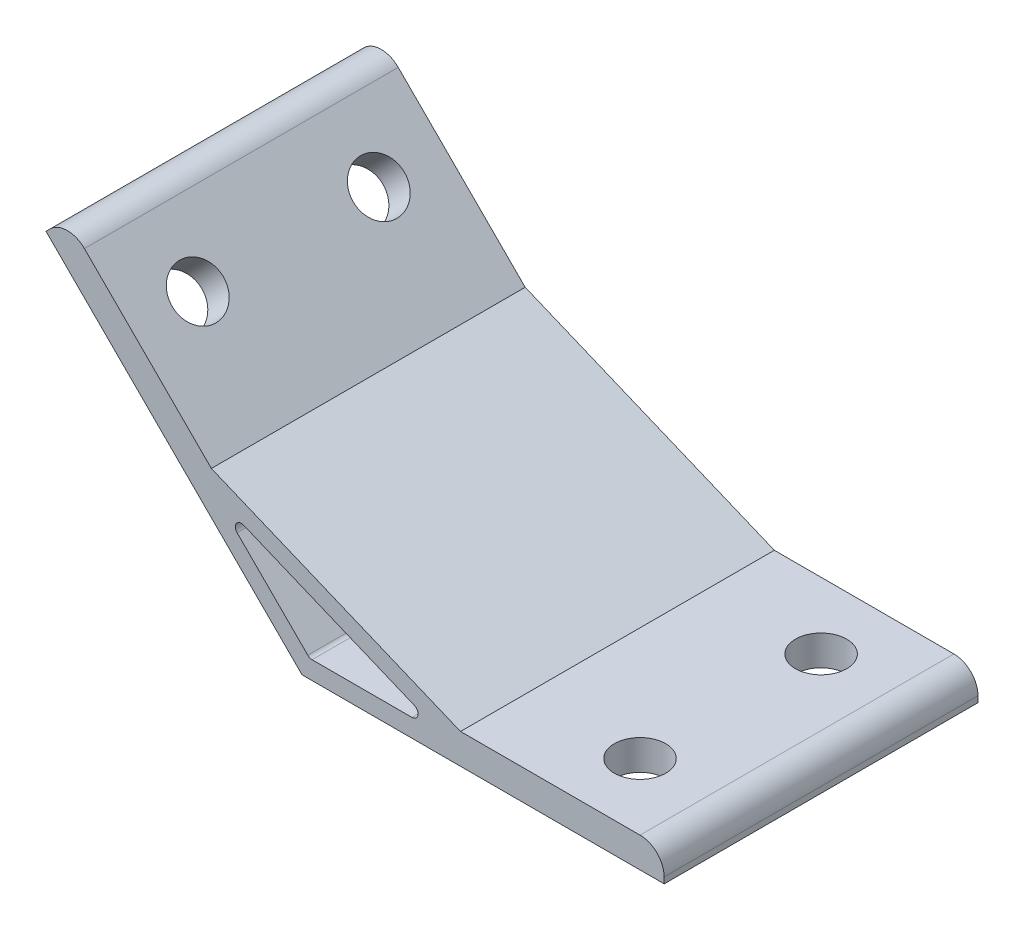
ISO-10303-21;
HEADER;
FILE_DESCRIPTION(('STEP AP214'),'2;1');
FILE_NAME('part.step','',(''),(''),'','','');
FILE_SCHEMA(('AUTOMOTIVE_DESIGN { 1 0 10303 214 1 1 1 1 }'));
ENDSEC;
DATA;
#1=APPLICATION_CONTEXT('core data for automotive mechanical design processes');
#2=APPLICATION_PROTOCOL_DEFINITION('international standard','automotive_design',2000,#1);
#3=PRODUCT_CONTEXT('',#1,'mechanical');
#4=PRODUCT('Part','Part','',(#3));
#5=PRODUCT_RELATED_PRODUCT_CATEGORY('part','',(#4));
#6=PRODUCT_DEFINITION_FORMATION('','',#4);
#7=PRODUCT_DEFINITION_CONTEXT('part definition',#1,'design');
#8=PRODUCT_DEFINITION('design','',#6,#7);
#9=PRODUCT_DEFINITION_SHAPE('','',#8);
#10=(LENGTH_UNIT() NAMED_UNIT(*) SI_UNIT(.MILLI.,.METRE.));
#11=(NAMED_UNIT(*) PLANE_ANGLE_UNIT() SI_UNIT($,.RADIAN.));
#12=(NAMED_UNIT(*) SI_UNIT($,.STERADIAN.) SOLID_ANGLE_UNIT());
#13=UNCERTAINTY_MEASURE_WITH_UNIT(LENGTH_MEASURE(1.E-05),#10,'distance_accuracy_value','');
#14=(GEOMETRIC_REPRESENTATION_CONTEXT(3) GLOBAL_UNCERTAINTY_ASSIGNED_CONTEXT((#13)) GLOBAL_UNIT_ASSIGNED_CONTEXT((#10,
#11,#12)) REPRESENTATION_CONTEXT('',''));
#15=CARTESIAN_POINT('',(0.,0.,0.));
#16=DIRECTION('',(0.,0.,1.));
#17=DIRECTION('',(1.,0.,0.));
#18=AXIS2_PLACEMENT_3D('',#15,#16,#17);
#19=CARTESIAN_POINT('',(0.,0.,26.));
#20=DIRECTION('',(0.,0.,1.));
#21=DIRECTION('',(1.,0.,0.));
#22=AXIS2_PLACEMENT_3D('',#19,#20,#21);
#23=PLANE('',#22);
#24=DIRECTION('',(0.,1.,0.));
#25=VECTOR('',#24,1.);
#26=CARTESIAN_POINT('',(60.,5.,26.));
#27=LINE('',#26,#25);
#28=CARTESIAN_POINT('',(60.,0.,26.));
#29=VERTEX_POINT('',#28);
#30=CARTESIAN_POINT('',(60.,1.,26.));
#31=VERTEX_POINT('',#30);
#32=EDGE_CURVE('E142',#29,#31,#27,.T.);
#33=ORIENTED_EDGE('',*,*,#32,.T.);
#34=CARTESIAN_POINT('',(56.,1.,26.));
#35=DIRECTION('',(0.,0.,1.));
#36=DIRECTION('',(1.,0.,0.));
#37=AXIS2_PLACEMENT_3D('',#34,#35,#36);
#38=CIRCLE('',#37,4.);
#39=CARTESIAN_POINT('',(56.,5.,26.));
#40=VERTEX_POINT('',#39);
#41=EDGE_CURVE('E184',#31,#40,#38,.T.);
#42=ORIENTED_EDGE('',*,*,#41,.T.);
#43=DIRECTION('',(-1.,0.,0.));
#44=VECTOR('',#43,1.);
#45=CARTESIAN_POINT('',(26.2535913516314,5.,26.));
#46=LINE('',#45,#44);
#47=CARTESIAN_POINT('',(26.2535913516314,5.,26.));
#48=VERTEX_POINT('',#47);
#49=EDGE_CURVE('E153',#40,#48,#46,.T.);
#50=ORIENTED_EDGE('',*,*,#49,.T.);
#51=DIRECTION('',(-0.923879532511286,0.382683432365091,0.));
#52=VECTOR('',#51,1.);
#53=CARTESIAN_POINT('',(-15.0285585693063,22.0996263811718,26.));
#54=LINE('',#53,#52);
#55=CARTESIAN_POINT('',(-15.0285585693063,22.0996263811718,26.));
#56=VERTEX_POINT('',#55);
#57=EDGE_CURVE('E244',#48,#56,#54,.T.);
#58=ORIENTED_EDGE('',*,*,#57,.T.);
#59=DIRECTION('',(-0.707106781186549,0.707106781186547,0.));
#60=VECTOR('',#59,1.);
#61=CARTESIAN_POINT('',(-38.8908729652601,45.9619407771256,26.));
#62=LINE('',#61,#60);
#63=CARTESIAN_POINT('',(-36.0624458405139,43.1335136523794,26.));
#64=VERTEX_POINT('',#63);
#65=EDGE_CURVE('E246',#56,#64,#62,.T.);
#66=ORIENTED_EDGE('',*,*,#65,.T.);
#67=CARTESIAN_POINT('',(-38.8908729652601,40.3050865276332,26.));
#68=DIRECTION('',(0.,0.,1.));
#69=DIRECTION('',(1.,0.,0.));
#70=AXIS2_PLACEMENT_3D('',#67,#68,#69);
#71=CIRCLE('',#70,4.);
#72=CARTESIAN_POINT('',(-41.7193000900063,43.1335136523794,26.));
#73=VERTEX_POINT('',#72);
#74=EDGE_CURVE('E182',#64,#73,#71,.T.);
#75=ORIENTED_EDGE('',*,*,#74,.T.);
#76=DIRECTION('',(-0.707106781186547,-0.707106781186548,0.));
#77=VECTOR('',#76,1.);
#78=CARTESIAN_POINT('',(-42.4264068711928,42.4264068711929,26.));
#79=LINE('',#78,#77);
#80=CARTESIAN_POINT('',(-42.4264068711928,42.4264068711929,26.));
#81=VERTEX_POINT('',#80);
#82=EDGE_CURVE('E249',#73,#81,#79,.T.);
#83=ORIENTED_EDGE('',*,*,#82,.T.);
#84=DIRECTION('',(0.707106781186546,-0.707106781186549,0.));
#85=VECTOR('',#84,1.);
#86=CARTESIAN_POINT('',(0.,0.,26.));
#87=LINE('',#86,#85);
#88=CARTESIAN_POINT('',(0.,0.,26.));
#89=VERTEX_POINT('',#88);
#90=EDGE_CURVE('E158',#81,#89,#87,.T.);
#91=ORIENTED_EDGE('',*,*,#90,.T.);
#92=DIRECTION('',(1.,0.,0.));
#93=VECTOR('',#92,1.);
#94=CARTESIAN_POINT('',(60.,0.,26.));
#95=LINE('',#94,#93);
#96=EDGE_CURVE('E154',#89,#29,#95,.T.);
#97=ORIENTED_EDGE('',*,*,#96,.T.);
#98=EDGE_LOOP('',(#33,#42,#50,#58,#66,#75,#83,#91,#97));
#99=FACE_BOUND('',#98,.T.);
#100=DIRECTION('',(1.,0.,0.));
#101=VECTOR('',#100,1.);
#102=CARTESIAN_POINT('',(23.2426406871193,3.,26.));
#103=LINE('',#102,#101);
#104=CARTESIAN_POINT('',(1.65685424949239,3.,26.));
#105=VERTEX_POINT('',#104);
#106=CARTESIAN_POINT('',(18.2153011949934,3.,26.));
#107=VERTEX_POINT('',#106);
#108=EDGE_CURVE('E229',#105,#107,#103,.T.);
#109=ORIENTED_EDGE('',*,*,#108,.F.);
#110=CARTESIAN_POINT('',(1.65685424949239,4.,26.));
#111=DIRECTION('',(0.,0.,1.));
#112=DIRECTION('',(1.,0.,0.));
#113=AXIS2_PLACEMENT_3D('',#110,#111,#112);
#114=CIRCLE('',#113,1.);
#115=CARTESIAN_POINT('',(0.949747468305838,3.29289321881345,26.));
#116=VERTEX_POINT('',#115);
#117=EDGE_CURVE('E211',#105,#116,#114,.F.);
#118=ORIENTED_EDGE('',*,*,#117,.T.);
#119=DIRECTION('',(0.707106781186546,-0.707106781186549,0.));
#120=VECTOR('',#119,1.);
#121=CARTESIAN_POINT('',(1.24264068711929,3.,26.));
#122=LINE('',#121,#120);
#123=CARTESIAN_POINT('',(-10.7588426527756,15.001483339895,26.));
#124=VERTEX_POINT('',#123);
#125=EDGE_CURVE('E226',#124,#116,#122,.T.);
#126=ORIENTED_EDGE('',*,*,#125,.F.);
#127=CARTESIAN_POINT('',(-10.0517358715891,15.7085901210815,26.));
#128=DIRECTION('',(0.,0.,1.));
#129=DIRECTION('',(1.,0.,0.));
#130=AXIS2_PLACEMENT_3D('',#127,#128,#129);
#131=CIRCLE('',#130,1.);
#132=CARTESIAN_POINT('',(-9.66905243922399,16.6324696535928,26.));
#133=VERTEX_POINT('',#132);
#134=EDGE_CURVE('E207',#124,#133,#131,.F.);
#135=ORIENTED_EDGE('',*,*,#134,.T.);
#136=DIRECTION('',(-0.923879532511286,0.382683432365091,0.));
#137=VECTOR('',#136,1.);
#138=CARTESIAN_POINT('',(-14.3137084989847,18.5563491861041,26.));
#139=LINE('',#138,#137);
#140=CARTESIAN_POINT('',(18.5979846273585,4.92387953251129,26.));
#141=VERTEX_POINT('',#140);
#142=EDGE_CURVE('E231',#141,#133,#139,.T.);
#143=ORIENTED_EDGE('',*,*,#142,.F.);
#144=CARTESIAN_POINT('',(18.2153011949934,4.,26.));
#145=DIRECTION('',(0.,0.,1.));
#146=DIRECTION('',(1.,0.,0.));
#147=AXIS2_PLACEMENT_3D('',#144,#145,#146);
#148=CIRCLE('',#147,1.);
#149=EDGE_CURVE('E11',#141,#107,#148,.F.);
#150=ORIENTED_EDGE('',*,*,#149,.T.);
#151=EDGE_LOOP('',(#109,#118,#126,#135,#143,#150));
#152=FACE_BOUND('',#151,.T.);
#153=ADVANCED_FACE('F35',(#99,#152),#23,.T.);
#154=CARTESIAN_POINT('',(0.,0.,-26.));
#155=DIRECTION('',(0.,0.,1.));
#156=DIRECTION('',(1.,0.,0.));
#157=AXIS2_PLACEMENT_3D('',#154,#155,#156);
#158=PLANE('',#157);
#159=DIRECTION('',(-1.,0.,0.));
#160=VECTOR('',#159,1.);
#161=CARTESIAN_POINT('',(26.2535913516314,5.,-26.));
#162=LINE('',#161,#160);
#163=CARTESIAN_POINT('',(56.,5.,-26.));
#164=VERTEX_POINT('',#163);
#165=CARTESIAN_POINT('',(26.2535913516314,5.,-26.));
#166=VERTEX_POINT('',#165);
#167=EDGE_CURVE('E256',#164,#166,#162,.T.);
#168=ORIENTED_EDGE('',*,*,#167,.F.);
#169=CARTESIAN_POINT('',(56.,1.,-26.));
#170=DIRECTION('',(0.,0.,1.));
#171=DIRECTION('',(1.,0.,0.));
#172=AXIS2_PLACEMENT_3D('',#169,#170,#171);
#173=CIRCLE('',#172,4.);
#174=CARTESIAN_POINT('',(60.,1.,-26.));
#175=VERTEX_POINT('',#174);
#176=EDGE_CURVE('E179',#164,#175,#173,.F.);
#177=ORIENTED_EDGE('',*,*,#176,.T.);
#178=DIRECTION('',(0.,1.,0.));
#179=VECTOR('',#178,1.);
#180=CARTESIAN_POINT('',(60.,5.,-26.));
#181=LINE('',#180,#179);
#182=CARTESIAN_POINT('',(60.,0.,-26.));
#183=VERTEX_POINT('',#182);
#184=EDGE_CURVE('E254',#183,#175,#181,.T.);
#185=ORIENTED_EDGE('',*,*,#184,.F.);
#186=DIRECTION('',(1.,0.,0.));
#187=VECTOR('',#186,1.);
#188=CARTESIAN_POINT('',(60.,0.,-26.));
#189=LINE('',#188,#187);
#190=CARTESIAN_POINT('',(0.,0.,-26.));
#191=VERTEX_POINT('',#190);
#192=EDGE_CURVE('E166',#191,#183,#189,.T.);
#193=ORIENTED_EDGE('',*,*,#192,.F.);
#194=DIRECTION('',(0.707106781186546,-0.707106781186549,0.));
#195=VECTOR('',#194,1.);
#196=CARTESIAN_POINT('',(0.,0.,-26.));
#197=LINE('',#196,#195);
#198=CARTESIAN_POINT('',(-42.4264068711928,42.4264068711929,-26.));
#199=VERTEX_POINT('',#198);
#200=EDGE_CURVE('E162',#199,#191,#197,.T.);
#201=ORIENTED_EDGE('',*,*,#200,.F.);
#202=DIRECTION('',(-0.707106781186547,-0.707106781186548,0.));
#203=VECTOR('',#202,1.);
#204=CARTESIAN_POINT('',(-42.4264068711928,42.4264068711929,-26.));
#205=LINE('',#204,#203);
#206=CARTESIAN_POINT('',(-41.7193000900063,43.1335136523794,-26.));
#207=VERTEX_POINT('',#206);
#208=EDGE_CURVE('E263',#207,#199,#205,.T.);
#209=ORIENTED_EDGE('',*,*,#208,.F.);
#210=CARTESIAN_POINT('',(-38.8908729652601,40.3050865276332,-26.));
#211=DIRECTION('',(0.,0.,1.));
#212=DIRECTION('',(1.,0.,0.));
#213=AXIS2_PLACEMENT_3D('',#210,#211,#212);
#214=CIRCLE('',#213,4.);
#215=CARTESIAN_POINT('',(-36.0624458405139,43.1335136523794,-26.));
#216=VERTEX_POINT('',#215);
#217=EDGE_CURVE('E171',#207,#216,#214,.F.);
#218=ORIENTED_EDGE('',*,*,#217,.T.);
#219=DIRECTION('',(-0.707106781186549,0.707106781186547,0.));
#220=VECTOR('',#219,1.);
#221=CARTESIAN_POINT('',(-38.8908729652601,45.9619407771256,-26.));
#222=LINE('',#221,#220);
#223=CARTESIAN_POINT('',(-15.0285585693063,22.0996263811718,-26.));
#224=VERTEX_POINT('',#223);
#225=EDGE_CURVE('E260',#224,#216,#222,.T.);
#226=ORIENTED_EDGE('',*,*,#225,.F.);
#227=DIRECTION('',(-0.923879532511286,0.382683432365091,0.));
#228=VECTOR('',#227,1.);
#229=CARTESIAN_POINT('',(-15.0285585693063,22.0996263811718,-26.));
#230=LINE('',#229,#228);
#231=EDGE_CURVE('E258',#166,#224,#230,.T.);
#232=ORIENTED_EDGE('',*,*,#231,.F.);
#233=EDGE_LOOP('',(#168,#177,#185,#193,#201,#209,#218,#226,#232));
#234=FACE_BOUND('',#233,.T.);
#235=DIRECTION('',(-0.923879532511286,0.382683432365091,0.));
#236=VECTOR('',#235,1.);
#237=CARTESIAN_POINT('',(-14.3137084989847,18.5563491861041,-26.));
#238=LINE('',#237,#236);
#239=CARTESIAN_POINT('',(18.5979846273585,4.92387953251129,-26.));
#240=VERTEX_POINT('',#239);
#241=CARTESIAN_POINT('',(-9.66905243922399,16.6324696535928,-26.));
#242=VERTEX_POINT('',#241);
#243=EDGE_CURVE('E217',#240,#242,#238,.T.);
#244=ORIENTED_EDGE('',*,*,#243,.T.);
#245=CARTESIAN_POINT('',(-10.0517358715891,15.7085901210815,-26.));
#246=DIRECTION('',(0.,0.,1.));
#247=DIRECTION('',(1.,0.,0.));
#248=AXIS2_PLACEMENT_3D('',#245,#246,#247);
#249=CIRCLE('',#248,1.);
#250=CARTESIAN_POINT('',(-10.7588426527756,15.001483339895,-26.));
#251=VERTEX_POINT('',#250);
#252=EDGE_CURVE('E205',#242,#251,#249,.T.);
#253=ORIENTED_EDGE('',*,*,#252,.T.);
#254=DIRECTION('',(0.707106781186546,-0.707106781186549,0.));
#255=VECTOR('',#254,1.);
#256=CARTESIAN_POINT('',(1.24264068711929,3.,-26.));
#257=LINE('',#256,#255);
#258=CARTESIAN_POINT('',(0.949747468305838,3.29289321881345,-26.));
#259=VERTEX_POINT('',#258);
#260=EDGE_CURVE('E238',#251,#259,#257,.T.);
#261=ORIENTED_EDGE('',*,*,#260,.T.);
#262=CARTESIAN_POINT('',(1.65685424949239,4.,-26.));
#263=DIRECTION('',(0.,0.,1.));
#264=DIRECTION('',(1.,0.,0.));
#265=AXIS2_PLACEMENT_3D('',#262,#263,#264);
#266=CIRCLE('',#265,1.);
#267=CARTESIAN_POINT('',(1.65685424949239,3.,-26.));
#268=VERTEX_POINT('',#267);
#269=EDGE_CURVE('E209',#259,#268,#266,.T.);
#270=ORIENTED_EDGE('',*,*,#269,.T.);
#271=DIRECTION('',(1.,0.,0.));
#272=VECTOR('',#271,1.);
#273=CARTESIAN_POINT('',(23.2426406871193,3.,-26.));
#274=LINE('',#273,#272);
#275=CARTESIAN_POINT('',(18.2153011949934,3.,-26.));
#276=VERTEX_POINT('',#275);
#277=EDGE_CURVE('E218',#268,#276,#274,.T.);
#278=ORIENTED_EDGE('',*,*,#277,.T.);
#279=CARTESIAN_POINT('',(18.2153011949934,4.,-26.));
#280=DIRECTION('',(0.,0.,1.));
#281=DIRECTION('',(1.,0.,0.));
#282=AXIS2_PLACEMENT_3D('',#279,#280,#281);
#283=CIRCLE('',#282,1.);
#284=EDGE_CURVE('E43',#276,#240,#283,.T.);
#285=ORIENTED_EDGE('',*,*,#284,.T.);
#286=EDGE_LOOP('',(#244,#253,#261,#270,#278,#285));
#287=FACE_BOUND('',#286,.T.);
#288=ADVANCED_FACE('F216',(#234,#287),#158,.F.);
#289=CARTESIAN_POINT('',(60.,0.,26.));
#290=DIRECTION('',(0.,1.,0.));
#291=DIRECTION('',(0.,0.,1.));
#292=AXIS2_PLACEMENT_3D('',#289,#290,#291);
#293=PLANE('',#292);
#294=CARTESIAN_POINT('',(45.,0.,15.));
#295=DIRECTION('',(0.,-1.,0.));
#296=DIRECTION('',(0.,0.,-1.));
#297=AXIS2_PLACEMENT_3D('',#294,#295,#296);
#298=CIRCLE('',#297,4.25);
#299=CARTESIAN_POINT('',(45.,0.,10.75));
#300=VERTEX_POINT('',#299);
#301=EDGE_CURVE('E344',#300,#300,#298,.T.);
#302=ORIENTED_EDGE('',*,*,#301,.F.);
#303=EDGE_LOOP('',(#302));
#304=FACE_BOUND('',#303,.T.);
#305=CARTESIAN_POINT('',(45.,0.,-15.));
#306=DIRECTION('',(0.,-1.,0.));
#307=DIRECTION('',(0.,0.,-1.));
#308=AXIS2_PLACEMENT_3D('',#305,#306,#307);
#309=CIRCLE('',#308,4.25000000000001);
#310=CARTESIAN_POINT('',(45.,0.,-19.25));
#311=VERTEX_POINT('',#310);
#312=EDGE_CURVE('E347',#311,#311,#309,.T.);
#313=ORIENTED_EDGE('',*,*,#312,.F.);
#314=EDGE_LOOP('',(#313));
#315=FACE_BOUND('',#314,.T.);
#316=ORIENTED_EDGE('',*,*,#192,.T.);
#317=DIRECTION('',(0.,0.,-1.));
#318=VECTOR('',#317,1.);
#319=CARTESIAN_POINT('',(60.,0.,26.));
#320=LINE('',#319,#318);
#321=EDGE_CURVE('E147',#29,#183,#320,.T.);
#322=ORIENTED_EDGE('',*,*,#321,.F.);
#323=ORIENTED_EDGE('',*,*,#96,.F.);
#324=DIRECTION('',(0.,0.,-1.));
#325=VECTOR('',#324,1.);
#326=CARTESIAN_POINT('',(0.,0.,26.));
#327=LINE('',#326,#325);
#328=EDGE_CURVE('E252',#89,#191,#327,.T.);
#329=ORIENTED_EDGE('',*,*,#328,.T.);
#330=EDGE_LOOP('',(#316,#322,#323,#329));
#331=FACE_BOUND('',#330,.T.);
#332=ADVANCED_FACE('F164',(#304,#315,#331),#293,.F.);
#333=CARTESIAN_POINT('',(60.,5.,26.));
#334=DIRECTION('',(-1.,0.,0.));
#335=DIRECTION('',(0.,0.,1.));
#336=AXIS2_PLACEMENT_3D('',#333,#334,#335);
#337=PLANE('',#336);
#338=ORIENTED_EDGE('',*,*,#184,.T.);
#339=DIRECTION('',(0.,0.,-1.));
#340=VECTOR('',#339,1.);
#341=CARTESIAN_POINT('',(60.,1.,26.));
#342=LINE('',#341,#340);
#343=EDGE_CURVE('E150',#175,#31,#342,.F.);
#344=ORIENTED_EDGE('',*,*,#343,.T.);
#345=ORIENTED_EDGE('',*,*,#32,.F.);
#346=ORIENTED_EDGE('',*,*,#321,.T.);
#347=EDGE_LOOP('',(#338,#344,#345,#346));
#348=FACE_BOUND('',#347,.T.);
#349=ADVANCED_FACE('F145',(#348),#337,.F.);
#350=CARTESIAN_POINT('',(26.2535913516314,5.,26.));
#351=DIRECTION('',(0.,-1.,0.));
#352=DIRECTION('',(0.,0.,-1.));
#353=AXIS2_PLACEMENT_3D('',#350,#351,#352);
#354=PLANE('',#353);
#355=CARTESIAN_POINT('',(45.,5.,15.));
#356=DIRECTION('',(0.,-1.,0.));
#357=DIRECTION('',(0.,0.,-1.));
#358=AXIS2_PLACEMENT_3D('',#355,#356,#357);
#359=CIRCLE('',#358,4.25);
#360=CARTESIAN_POINT('',(45.,5.,10.75));
#361=VERTEX_POINT('',#360);
#362=EDGE_CURVE('E354',#361,#361,#359,.F.);
#363=ORIENTED_EDGE('',*,*,#362,.F.);
#364=EDGE_LOOP('',(#363));
#365=FACE_BOUND('',#364,.T.);
#366=CARTESIAN_POINT('',(45.,5.,-15.));
#367=DIRECTION('',(0.,-1.,0.));
#368=DIRECTION('',(0.,0.,-1.));
#369=AXIS2_PLACEMENT_3D('',#366,#367,#368);
#370=CIRCLE('',#369,4.25000000000001);
#371=CARTESIAN_POINT('',(45.,5.,-19.25));
#372=VERTEX_POINT('',#371);
#373=EDGE_CURVE('E349',#372,#372,#370,.F.);
#374=ORIENTED_EDGE('',*,*,#373,.F.);
#375=EDGE_LOOP('',(#374));
#376=FACE_BOUND('',#375,.T.);
#377=ORIENTED_EDGE('',*,*,#49,.F.);
#378=DIRECTION('',(0.,0.,-1.));
#379=VECTOR('',#378,1.);
#380=CARTESIAN_POINT('',(56.,5.,26.));
#381=LINE('',#380,#379);
#382=EDGE_CURVE('E167',#40,#164,#381,.T.);
#383=ORIENTED_EDGE('',*,*,#382,.T.);
#384=ORIENTED_EDGE('',*,*,#167,.T.);
#385=DIRECTION('',(0.,0.,-1.));
#386=VECTOR('',#385,1.);
#387=CARTESIAN_POINT('',(26.2535913516314,5.,26.));
#388=LINE('',#387,#386);
#389=EDGE_CURVE('E168',#48,#166,#388,.T.);
#390=ORIENTED_EDGE('',*,*,#389,.F.);
#391=EDGE_LOOP('',(#377,#383,#384,#390));
#392=FACE_BOUND('',#391,.T.);
#393=ADVANCED_FACE('F295',(#365,#376,#392),#354,.F.);
#394=CARTESIAN_POINT('',(-15.0285585693063,22.0996263811718,26.));
#395=DIRECTION('',(-0.382683432365091,-0.923879532511286,0.));
#396=DIRECTION('',(0.923879532511286,-0.382683432365091,0.));
#397=AXIS2_PLACEMENT_3D('',#394,#395,#396);
#398=PLANE('',#397);
#399=ORIENTED_EDGE('',*,*,#231,.T.);
#400=DIRECTION('',(0.,0.,-1.));
#401=VECTOR('',#400,1.);
#402=CARTESIAN_POINT('',(-15.0285585693063,22.0996263811718,26.));
#403=LINE('',#402,#401);
#404=EDGE_CURVE('E174',#56,#224,#403,.T.);
#405=ORIENTED_EDGE('',*,*,#404,.F.);
#406=ORIENTED_EDGE('',*,*,#57,.F.);
#407=ORIENTED_EDGE('',*,*,#389,.T.);
#408=EDGE_LOOP('',(#399,#405,#406,#407));
#409=FACE_BOUND('',#408,.T.);
#410=ADVANCED_FACE('F293',(#409),#398,.F.);
#411=CARTESIAN_POINT('',(-38.8908729652601,45.9619407771256,26.));
#412=DIRECTION('',(-0.707106781186547,-0.707106781186548,0.));
#413=DIRECTION('',(0.707106781186548,-0.707106781186547,0.));
#414=AXIS2_PLACEMENT_3D('',#411,#412,#413);
#415=PLANE('',#414);
#416=CARTESIAN_POINT('',(-28.2842712474619,35.3553390593274,-15.));
#417=DIRECTION('',(-0.707106781186547,-0.707106781186548,0.));
#418=DIRECTION('',(0.707106781186548,-0.707106781186547,0.));
#419=AXIS2_PLACEMENT_3D('',#416,#417,#418);
#420=CIRCLE('',#419,4.25);
#421=CARTESIAN_POINT('',(-25.279067427419,32.3501352392846,-15.));
#422=VERTEX_POINT('',#421);
#423=EDGE_CURVE('E241',#422,#422,#420,.F.);
#424=ORIENTED_EDGE('',*,*,#423,.F.);
#425=EDGE_LOOP('',(#424));
#426=FACE_BOUND('',#425,.T.);
#427=CARTESIAN_POINT('',(-28.2842712474619,35.3553390593274,15.));
#428=DIRECTION('',(-0.707106781186547,-0.707106781186548,0.));
#429=DIRECTION('',(0.707106781186548,-0.707106781186547,0.));
#430=AXIS2_PLACEMENT_3D('',#427,#428,#429);
#431=CIRCLE('',#430,4.25000000000001);
#432=CARTESIAN_POINT('',(-25.279067427419,32.3501352392846,15.));
#433=VERTEX_POINT('',#432);
#434=EDGE_CURVE('E360',#433,#433,#431,.F.);
#435=ORIENTED_EDGE('',*,*,#434,.F.);
#436=EDGE_LOOP('',(#435));
#437=FACE_BOUND('',#436,.T.);
#438=ORIENTED_EDGE('',*,*,#225,.T.);
#439=DIRECTION('',(0.,0.,-1.));
#440=VECTOR('',#439,1.);
#441=CARTESIAN_POINT('',(-36.0624458405139,43.1335136523794,26.));
#442=LINE('',#441,#440);
#443=EDGE_CURVE('E189',#216,#64,#442,.F.);
#444=ORIENTED_EDGE('',*,*,#443,.T.);
#445=ORIENTED_EDGE('',*,*,#65,.F.);
#446=ORIENTED_EDGE('',*,*,#404,.T.);
#447=EDGE_LOOP('',(#438,#444,#445,#446));
#448=FACE_BOUND('',#447,.T.);
#449=ADVANCED_FACE('F274',(#426,#437,#448),#415,.F.);
#450=CARTESIAN_POINT('',(-42.4264068711928,42.4264068711929,26.));
#451=DIRECTION('',(0.707106781186548,-0.707106781186547,0.));
#452=DIRECTION('',(0.707106781186547,0.707106781186548,0.));
#453=AXIS2_PLACEMENT_3D('',#450,#451,#452);
#454=PLANE('',#453);
#455=ORIENTED_EDGE('',*,*,#82,.F.);
#456=DIRECTION('',(0.,0.,-1.));
#457=VECTOR('',#456,1.);
#458=CARTESIAN_POINT('',(-41.7193000900063,43.1335136523794,26.));
#459=LINE('',#458,#457);
#460=EDGE_CURVE('E186',#73,#207,#459,.T.);
#461=ORIENTED_EDGE('',*,*,#460,.T.);
#462=ORIENTED_EDGE('',*,*,#208,.T.);
#463=DIRECTION('',(0.,0.,-1.));
#464=VECTOR('',#463,1.);
#465=CARTESIAN_POINT('',(-42.4264068711928,42.4264068711929,26.));
#466=LINE('',#465,#464);
#467=EDGE_CURVE('E267',#81,#199,#466,.T.);
#468=ORIENTED_EDGE('',*,*,#467,.F.);
#469=EDGE_LOOP('',(#455,#461,#462,#468));
#470=FACE_BOUND('',#469,.T.);
#471=ADVANCED_FACE('F289',(#470),#454,.F.);
#472=CARTESIAN_POINT('',(0.,0.,26.));
#473=DIRECTION('',(0.707106781186549,0.707106781186546,0.));
#474=DIRECTION('',(-0.707106781186546,0.707106781186549,0.));
#475=AXIS2_PLACEMENT_3D('',#472,#473,#474);
#476=PLANE('',#475);
#477=CARTESIAN_POINT('',(-31.8198051533946,31.8198051533947,-15.));
#478=DIRECTION('',(-0.707106781186549,-0.707106781186546,0.));
#479=DIRECTION('',(0.707106781186546,-0.707106781186549,0.));
#480=AXIS2_PLACEMENT_3D('',#477,#478,#479);
#481=CIRCLE('',#480,4.25);
#482=CARTESIAN_POINT('',(-28.8146013333518,28.8146013333519,-15.));
#483=VERTEX_POINT('',#482);
#484=EDGE_CURVE('E357',#483,#483,#481,.T.);
#485=ORIENTED_EDGE('',*,*,#484,.F.);
#486=EDGE_LOOP('',(#485));
#487=FACE_BOUND('',#486,.T.);
#488=CARTESIAN_POINT('',(-31.8198051533946,31.8198051533947,15.));
#489=DIRECTION('',(-0.707106781186549,-0.707106781186546,0.));
#490=DIRECTION('',(0.707106781186546,-0.707106781186549,0.));
#491=AXIS2_PLACEMENT_3D('',#488,#489,#490);
#492=CIRCLE('',#491,4.25000000000001);
#493=CARTESIAN_POINT('',(-28.8146013333518,28.8146013333518,15.));
#494=VERTEX_POINT('',#493);
#495=EDGE_CURVE('E363',#494,#494,#492,.T.);
#496=ORIENTED_EDGE('',*,*,#495,.F.);
#497=EDGE_LOOP('',(#496));
#498=FACE_BOUND('',#497,.T.);
#499=ORIENTED_EDGE('',*,*,#200,.T.);
#500=ORIENTED_EDGE('',*,*,#328,.F.);
#501=ORIENTED_EDGE('',*,*,#90,.F.);
#502=ORIENTED_EDGE('',*,*,#467,.T.);
#503=EDGE_LOOP('',(#499,#500,#501,#502));
#504=FACE_BOUND('',#503,.T.);
#505=ADVANCED_FACE('F322',(#487,#498,#504),#476,.F.);
#506=CARTESIAN_POINT('',(1.24264068711929,3.,26.));
#507=DIRECTION('',(0.707106781186549,0.707106781186546,0.));
#508=DIRECTION('',(-0.707106781186546,0.707106781186549,0.));
#509=AXIS2_PLACEMENT_3D('',#506,#507,#508);
#510=PLANE('',#509);
#511=ORIENTED_EDGE('',*,*,#260,.F.);
#512=DIRECTION('',(0.,0.,-1.));
#513=VECTOR('',#512,1.);
#514=CARTESIAN_POINT('',(-10.7588426527756,15.001483339895,26.));
#515=LINE('',#514,#513);
#516=EDGE_CURVE('E199',#251,#124,#515,.F.);
#517=ORIENTED_EDGE('',*,*,#516,.T.);
#518=ORIENTED_EDGE('',*,*,#125,.T.);
#519=DIRECTION('',(0.,0.,-1.));
#520=VECTOR('',#519,1.);
#521=CARTESIAN_POINT('',(0.949747468305838,3.29289321881345,-26.));
#522=LINE('',#521,#520);
#523=EDGE_CURVE('E196',#116,#259,#522,.T.);
#524=ORIENTED_EDGE('',*,*,#523,.T.);
#525=EDGE_LOOP('',(#511,#517,#518,#524));
#526=FACE_BOUND('',#525,.T.);
#527=ADVANCED_FACE('F319',(#526),#510,.T.);
#528=CARTESIAN_POINT('',(23.2426406871193,3.,26.));
#529=DIRECTION('',(0.,1.,0.));
#530=DIRECTION('',(0.,0.,1.));
#531=AXIS2_PLACEMENT_3D('',#528,#529,#530);
#532=PLANE('',#531);
#533=ORIENTED_EDGE('',*,*,#277,.F.);
#534=DIRECTION('',(0.,0.,-1.));
#535=VECTOR('',#534,1.);
#536=CARTESIAN_POINT('',(1.65685424949239,3.,26.));
#537=LINE('',#536,#535);
#538=EDGE_CURVE('E55',#268,#105,#537,.F.);
#539=ORIENTED_EDGE('',*,*,#538,.T.);
#540=ORIENTED_EDGE('',*,*,#108,.T.);
#541=DIRECTION('',(0.,0.,-1.));
#542=VECTOR('',#541,1.);
#543=CARTESIAN_POINT('',(18.2153011949934,3.,-26.));
#544=LINE('',#543,#542);
#545=EDGE_CURVE('E201',#107,#276,#544,.T.);
#546=ORIENTED_EDGE('',*,*,#545,.T.);
#547=EDGE_LOOP('',(#533,#539,#540,#546));
#548=FACE_BOUND('',#547,.T.);
#549=ADVANCED_FACE('F228',(#548),#532,.T.);
#550=CARTESIAN_POINT('',(-14.3137084989847,18.5563491861041,26.));
#551=DIRECTION('',(-0.382683432365091,-0.923879532511286,0.));
#552=DIRECTION('',(0.923879532511286,-0.382683432365091,0.));
#553=AXIS2_PLACEMENT_3D('',#550,#551,#552);
#554=PLANE('',#553);
#555=ORIENTED_EDGE('',*,*,#142,.T.);
#556=DIRECTION('',(0.,0.,-1.));
#557=VECTOR('',#556,1.);
#558=CARTESIAN_POINT('',(-9.66905243922399,16.6324696535928,-26.));
#559=LINE('',#558,#557);
#560=EDGE_CURVE('E193',#133,#242,#559,.T.);
#561=ORIENTED_EDGE('',*,*,#560,.T.);
#562=ORIENTED_EDGE('',*,*,#243,.F.);
#563=DIRECTION('',(0.,0.,-1.));
#564=VECTOR('',#563,1.);
#565=CARTESIAN_POINT('',(18.5979846273585,4.92387953251129,26.));
#566=LINE('',#565,#564);
#567=EDGE_CURVE('E191',#240,#141,#566,.F.);
#568=ORIENTED_EDGE('',*,*,#567,.T.);
#569=EDGE_LOOP('',(#555,#561,#562,#568));
#570=FACE_BOUND('',#569,.T.);
#571=ADVANCED_FACE('F224',(#570),#554,.T.);
#572=CARTESIAN_POINT('',(-19.7842712474618,43.8553390593274,15.));
#573=DIRECTION('',(-0.707106781186549,-0.707106781186547,0.));
#574=DIRECTION('',(0.707106781186547,-0.707106781186549,0.));
#575=AXIS2_PLACEMENT_3D('',#572,#573,#574);
#576=CYLINDRICAL_SURFACE('',#575,4.25000000000001);
#577=ORIENTED_EDGE('',*,*,#434,.T.);
#578=EDGE_LOOP('',(#577));
#579=FACE_BOUND('',#578,.T.);
#580=ORIENTED_EDGE('',*,*,#495,.T.);
#581=EDGE_LOOP('',(#580));
#582=FACE_BOUND('',#581,.T.);
#583=ADVANCED_FACE('F368',(#579,#582),#576,.F.);
#584=CARTESIAN_POINT('',(-19.7842712474618,43.8553390593274,-15.));
#585=DIRECTION('',(-0.707106781186549,-0.707106781186547,0.));
#586=DIRECTION('',(0.707106781186547,-0.707106781186549,0.));
#587=AXIS2_PLACEMENT_3D('',#584,#585,#586);
#588=CYLINDRICAL_SURFACE('',#587,4.25);
#589=ORIENTED_EDGE('',*,*,#423,.T.);
#590=EDGE_LOOP('',(#589));
#591=FACE_BOUND('',#590,.T.);
#592=ORIENTED_EDGE('',*,*,#484,.T.);
#593=EDGE_LOOP('',(#592));
#594=FACE_BOUND('',#593,.T.);
#595=ADVANCED_FACE('F372',(#591,#594),#588,.F.);
#596=CARTESIAN_POINT('',(45.,17.0208152801713,-15.));
#597=DIRECTION('',(0.,-1.,0.));
#598=DIRECTION('',(0.,0.,-1.));
#599=AXIS2_PLACEMENT_3D('',#596,#597,#598);
#600=CYLINDRICAL_SURFACE('',#599,4.25000000000001);
#601=ORIENTED_EDGE('',*,*,#373,.T.);
#602=EDGE_LOOP('',(#601));
#603=FACE_BOUND('',#602,.T.);
#604=ORIENTED_EDGE('',*,*,#312,.T.);
#605=EDGE_LOOP('',(#604));
#606=FACE_BOUND('',#605,.T.);
#607=ADVANCED_FACE('F308',(#603,#606),#600,.F.);
#608=CARTESIAN_POINT('',(45.,17.0208152801713,15.));
#609=DIRECTION('',(0.,-1.,0.));
#610=DIRECTION('',(0.,0.,-1.));
#611=AXIS2_PLACEMENT_3D('',#608,#609,#610);
#612=CYLINDRICAL_SURFACE('',#611,4.25);
#613=ORIENTED_EDGE('',*,*,#362,.T.);
#614=EDGE_LOOP('',(#613));
#615=FACE_BOUND('',#614,.T.);
#616=ORIENTED_EDGE('',*,*,#301,.T.);
#617=EDGE_LOOP('',(#616));
#618=FACE_BOUND('',#617,.T.);
#619=ADVANCED_FACE('F300',(#615,#618),#612,.F.);
#620=CARTESIAN_POINT('',(56.,1.,26.));
#621=DIRECTION('',(0.,0.,-1.));
#622=DIRECTION('',(-1.,0.,0.));
#623=AXIS2_PLACEMENT_3D('',#620,#621,#622);
#624=CYLINDRICAL_SURFACE('',#623,4.);
#625=ORIENTED_EDGE('',*,*,#41,.F.);
#626=ORIENTED_EDGE('',*,*,#343,.F.);
#627=ORIENTED_EDGE('',*,*,#176,.F.);
#628=ORIENTED_EDGE('',*,*,#382,.F.);
#629=EDGE_LOOP('',(#625,#626,#627,#628));
#630=FACE_BOUND('',#629,.T.);
#631=ADVANCED_FACE('F298',(#630),#624,.T.);
#632=CARTESIAN_POINT('',(-38.8908729652601,40.3050865276332,26.));
#633=DIRECTION('',(0.,0.,-1.));
#634=DIRECTION('',(-1.,0.,0.));
#635=AXIS2_PLACEMENT_3D('',#632,#633,#634);
#636=CYLINDRICAL_SURFACE('',#635,4.);
#637=ORIENTED_EDGE('',*,*,#74,.F.);
#638=ORIENTED_EDGE('',*,*,#443,.F.);
#639=ORIENTED_EDGE('',*,*,#217,.F.);
#640=ORIENTED_EDGE('',*,*,#460,.F.);
#641=EDGE_LOOP('',(#637,#638,#639,#640));
#642=FACE_BOUND('',#641,.T.);
#643=ADVANCED_FACE('F286',(#642),#636,.T.);
#644=CARTESIAN_POINT('',(-10.0517358715891,15.7085901210815,26.));
#645=DIRECTION('',(0.,0.,1.));
#646=DIRECTION('',(1.,0.,0.));
#647=AXIS2_PLACEMENT_3D('',#644,#645,#646);
#648=CYLINDRICAL_SURFACE('',#647,1.);
#649=ORIENTED_EDGE('',*,*,#134,.F.);
#650=ORIENTED_EDGE('',*,*,#516,.F.);
#651=ORIENTED_EDGE('',*,*,#252,.F.);
#652=ORIENTED_EDGE('',*,*,#560,.F.);
#653=EDGE_LOOP('',(#649,#650,#651,#652));
#654=FACE_BOUND('',#653,.T.);
#655=ADVANCED_FACE('F306',(#654),#648,.F.);
#656=CARTESIAN_POINT('',(1.65685424949239,4.,26.));
#657=DIRECTION('',(0.,0.,1.));
#658=DIRECTION('',(1.,0.,0.));
#659=AXIS2_PLACEMENT_3D('',#656,#657,#658);
#660=CYLINDRICAL_SURFACE('',#659,1.);
#661=ORIENTED_EDGE('',*,*,#117,.F.);
#662=ORIENTED_EDGE('',*,*,#538,.F.);
#663=ORIENTED_EDGE('',*,*,#269,.F.);
#664=ORIENTED_EDGE('',*,*,#523,.F.);
#665=EDGE_LOOP('',(#661,#662,#663,#664));
#666=FACE_BOUND('',#665,.T.);
#667=ADVANCED_FACE('F399',(#666),#660,.F.);
#668=CARTESIAN_POINT('',(18.2153011949934,4.,26.));
#669=DIRECTION('',(0.,0.,1.));
#670=DIRECTION('',(1.,0.,0.));
#671=AXIS2_PLACEMENT_3D('',#668,#669,#670);
#672=CYLINDRICAL_SURFACE('',#671,1.);
#673=ORIENTED_EDGE('',*,*,#149,.F.);
#674=ORIENTED_EDGE('',*,*,#567,.F.);
#675=ORIENTED_EDGE('',*,*,#284,.F.);
#676=ORIENTED_EDGE('',*,*,#545,.F.);
#677=EDGE_LOOP('',(#673,#674,#675,#676));
#678=FACE_BOUND('',#677,.T.);
#679=ADVANCED_FACE('F37',(#678),#672,.F.);
#680=CLOSED_SHELL('',(#153,#288,#332,#349,#393,#410,#449,#471,#505,#527,#549,#571,#583,#595,
#607,#619,#631,#643,#655,#667,#679));
#681=MANIFOLD_SOLID_BREP('B2',#680);
#682=ADVANCED_BREP_SHAPE_REPRESENTATION('',(#18,#681),#14);
#683=SHAPE_DEFINITION_REPRESENTATION(#9,#682);
ENDSEC;
END-ISO-10303-21;
